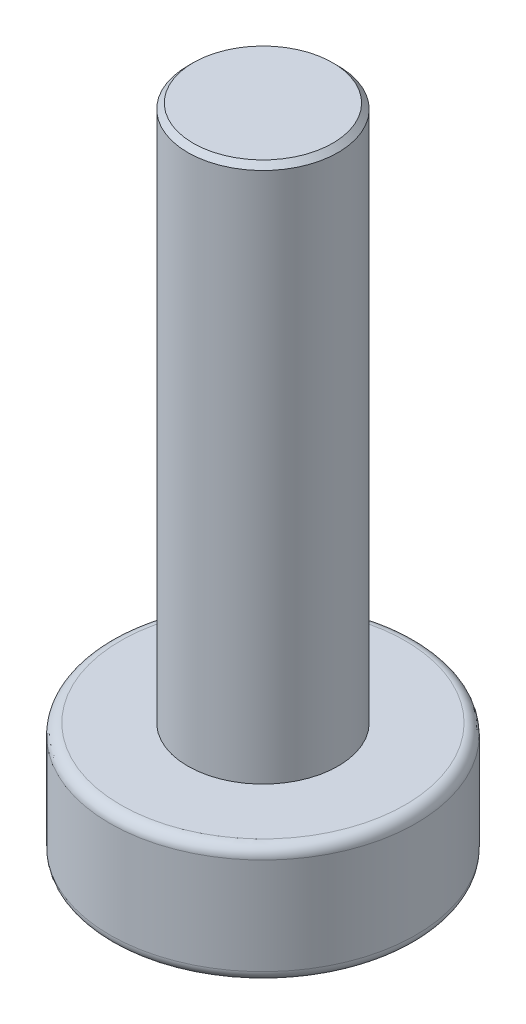
ISO-10303-21;
HEADER;
FILE_DESCRIPTION(('STEP AP214'),'2;1');
FILE_NAME('part.step','',(''),(''),'','','');
FILE_SCHEMA(('AUTOMOTIVE_DESIGN { 1 0 10303 214 1 1 1 1 }'));
ENDSEC;
DATA;
#1=APPLICATION_CONTEXT('core data for automotive mechanical design processes');
#2=APPLICATION_PROTOCOL_DEFINITION('international standard','automotive_design',2000,#1);
#3=PRODUCT_CONTEXT('',#1,'mechanical');
#4=PRODUCT('Part','Part','',(#3));
#5=PRODUCT_RELATED_PRODUCT_CATEGORY('part','',(#4));
#6=PRODUCT_DEFINITION_FORMATION('','',#4);
#7=PRODUCT_DEFINITION_CONTEXT('part definition',#1,'design');
#8=PRODUCT_DEFINITION('design','',#6,#7);
#9=PRODUCT_DEFINITION_SHAPE('','',#8);
#10=(LENGTH_UNIT() NAMED_UNIT(*) SI_UNIT(.MILLI.,.METRE.));
#11=(NAMED_UNIT(*) PLANE_ANGLE_UNIT() SI_UNIT($,.RADIAN.));
#12=(NAMED_UNIT(*) SI_UNIT($,.STERADIAN.) SOLID_ANGLE_UNIT());
#13=UNCERTAINTY_MEASURE_WITH_UNIT(LENGTH_MEASURE(1.E-05),#10,'distance_accuracy_value','');
#14=(GEOMETRIC_REPRESENTATION_CONTEXT(3) GLOBAL_UNCERTAINTY_ASSIGNED_CONTEXT((#13)) GLOBAL_UNIT_ASSIGNED_CONTEXT((#10,
#11,#12)) REPRESENTATION_CONTEXT('',''));
#15=CARTESIAN_POINT('',(0.,0.,0.));
#16=DIRECTION('',(0.,0.,1.));
#17=DIRECTION('',(1.,0.,0.));
#18=AXIS2_PLACEMENT_3D('',#15,#16,#17);
#19=CARTESIAN_POINT('',(0.,2.2,0.));
#20=DIRECTION('',(0.,-1.,0.));
#21=DIRECTION('',(0.,0.,-1.));
#22=AXIS2_PLACEMENT_3D('',#19,#20,#21);
#23=CYLINDRICAL_SURFACE('',#22,2.85);
#24=CARTESIAN_POINT('',(0.,2.,0.));
#25=DIRECTION('',(0.,1.,0.));
#26=DIRECTION('',(0.,0.,1.));
#27=AXIS2_PLACEMENT_3D('',#24,#25,#26);
#28=CIRCLE('',#27,2.85);
#29=CARTESIAN_POINT('',(0.,2.,2.85));
#30=VERTEX_POINT('',#29);
#31=EDGE_CURVE('E44',#30,#30,#28,.F.);
#32=ORIENTED_EDGE('',*,*,#31,.T.);
#33=EDGE_LOOP('',(#32));
#34=FACE_BOUND('',#33,.T.);
#35=CARTESIAN_POINT('',(0.,0.2,0.));
#36=DIRECTION('',(0.,1.,0.));
#37=DIRECTION('',(0.,0.,1.));
#38=AXIS2_PLACEMENT_3D('',#35,#36,#37);
#39=CIRCLE('',#38,2.85);
#40=CARTESIAN_POINT('',(0.,0.2,2.85));
#41=VERTEX_POINT('',#40);
#42=EDGE_CURVE('E221',#41,#41,#39,.T.);
#43=ORIENTED_EDGE('',*,*,#42,.T.);
#44=EDGE_LOOP('',(#43));
#45=FACE_BOUND('',#44,.T.);
#46=ADVANCED_FACE('F36',(#34,#45),#23,.T.);
#47=CARTESIAN_POINT('',(0.,2.2,0.));
#48=DIRECTION('',(0.,1.,0.));
#49=DIRECTION('',(0.,0.,1.));
#50=AXIS2_PLACEMENT_3D('',#47,#48,#49);
#51=PLANE('',#50);
#52=CARTESIAN_POINT('',(0.,2.2,0.));
#53=DIRECTION('',(0.,1.,0.));
#54=DIRECTION('',(0.,0.,1.));
#55=AXIS2_PLACEMENT_3D('',#52,#53,#54);
#56=CIRCLE('',#55,2.65);
#57=CARTESIAN_POINT('',(0.,2.2,2.65));
#58=VERTEX_POINT('',#57);
#59=EDGE_CURVE('E218',#58,#58,#56,.T.);
#60=ORIENTED_EDGE('',*,*,#59,.T.);
#61=EDGE_LOOP('',(#60));
#62=FACE_BOUND('',#61,.T.);
#63=CARTESIAN_POINT('',(0.,2.2,0.));
#64=DIRECTION('',(0.,1.,0.));
#65=DIRECTION('',(0.,0.,1.));
#66=AXIS2_PLACEMENT_3D('',#63,#64,#65);
#67=CIRCLE('',#66,1.4);
#68=CARTESIAN_POINT('',(0.,2.2,1.4));
#69=VERTEX_POINT('',#68);
#70=EDGE_CURVE('E192',#69,#69,#67,.T.);
#71=ORIENTED_EDGE('',*,*,#70,.F.);
#72=EDGE_LOOP('',(#71));
#73=FACE_BOUND('',#72,.T.);
#74=ADVANCED_FACE('F234',(#62,#73),#51,.T.);
#75=CARTESIAN_POINT('',(0.,0.,0.));
#76=DIRECTION('',(0.,1.,0.));
#77=DIRECTION('',(0.,0.,1.));
#78=AXIS2_PLACEMENT_3D('',#75,#76,#77);
#79=PLANE('',#78);
#80=DIRECTION('',(0.,0.,-1.));
#81=VECTOR('',#80,1.);
#82=CARTESIAN_POINT('',(-2.,0.,-0.5));
#83=LINE('',#82,#81);
#84=CARTESIAN_POINT('',(-2.,0.,0.5));
#85=VERTEX_POINT('',#84);
#86=CARTESIAN_POINT('',(-2.,0.,-0.5));
#87=VERTEX_POINT('',#86);
#88=EDGE_CURVE('E161',#85,#87,#83,.T.);
#89=ORIENTED_EDGE('',*,*,#88,.F.);
#90=DIRECTION('',(-1.,0.,0.));
#91=VECTOR('',#90,1.);
#92=CARTESIAN_POINT('',(-2.,0.,0.5));
#93=LINE('',#92,#91);
#94=CARTESIAN_POINT('',(-0.5,0.,0.5));
#95=VERTEX_POINT('',#94);
#96=EDGE_CURVE('E51',#95,#85,#93,.T.);
#97=ORIENTED_EDGE('',*,*,#96,.F.);
#98=DIRECTION('',(0.,0.,-1.));
#99=VECTOR('',#98,1.);
#100=CARTESIAN_POINT('',(-0.5,0.,0.5));
#101=LINE('',#100,#99);
#102=CARTESIAN_POINT('',(-0.5,0.,2.));
#103=VERTEX_POINT('',#102);
#104=EDGE_CURVE('E188',#103,#95,#101,.T.);
#105=ORIENTED_EDGE('',*,*,#104,.F.);
#106=DIRECTION('',(-1.,0.,0.));
#107=VECTOR('',#106,1.);
#108=CARTESIAN_POINT('',(-0.5,0.,2.));
#109=LINE('',#108,#107);
#110=CARTESIAN_POINT('',(0.5,0.,2.));
#111=VERTEX_POINT('',#110);
#112=EDGE_CURVE('E186',#111,#103,#109,.T.);
#113=ORIENTED_EDGE('',*,*,#112,.F.);
#114=DIRECTION('',(0.,0.,1.));
#115=VECTOR('',#114,1.);
#116=CARTESIAN_POINT('',(0.5,0.,2.));
#117=LINE('',#116,#115);
#118=CARTESIAN_POINT('',(0.5,0.,0.5));
#119=VERTEX_POINT('',#118);
#120=EDGE_CURVE('E135',#119,#111,#117,.T.);
#121=ORIENTED_EDGE('',*,*,#120,.F.);
#122=DIRECTION('',(-1.,0.,0.));
#123=VECTOR('',#122,1.);
#124=CARTESIAN_POINT('',(0.5,0.,0.5));
#125=LINE('',#124,#123);
#126=CARTESIAN_POINT('',(2.,0.,0.5));
#127=VERTEX_POINT('',#126);
#128=EDGE_CURVE('E182',#127,#119,#125,.T.);
#129=ORIENTED_EDGE('',*,*,#128,.F.);
#130=DIRECTION('',(0.,0.,1.));
#131=VECTOR('',#130,1.);
#132=CARTESIAN_POINT('',(2.,0.,0.5));
#133=LINE('',#132,#131);
#134=CARTESIAN_POINT('',(2.,0.,-0.5));
#135=VERTEX_POINT('',#134);
#136=EDGE_CURVE('E179',#135,#127,#133,.T.);
#137=ORIENTED_EDGE('',*,*,#136,.F.);
#138=DIRECTION('',(1.,0.,0.));
#139=VECTOR('',#138,1.);
#140=CARTESIAN_POINT('',(2.,0.,-0.5));
#141=LINE('',#140,#139);
#142=CARTESIAN_POINT('',(0.5,0.,-0.5));
#143=VERTEX_POINT('',#142);
#144=EDGE_CURVE('E176',#143,#135,#141,.T.);
#145=ORIENTED_EDGE('',*,*,#144,.F.);
#146=DIRECTION('',(0.,0.,1.));
#147=VECTOR('',#146,1.);
#148=CARTESIAN_POINT('',(0.5,0.,-0.5));
#149=LINE('',#148,#147);
#150=CARTESIAN_POINT('',(0.5,0.,-2.));
#151=VERTEX_POINT('',#150);
#152=EDGE_CURVE('E173',#151,#143,#149,.T.);
#153=ORIENTED_EDGE('',*,*,#152,.F.);
#154=DIRECTION('',(1.,0.,0.));
#155=VECTOR('',#154,1.);
#156=CARTESIAN_POINT('',(0.5,0.,-2.));
#157=LINE('',#156,#155);
#158=CARTESIAN_POINT('',(-0.5,0.,-2.));
#159=VERTEX_POINT('',#158);
#160=EDGE_CURVE('E170',#159,#151,#157,.T.);
#161=ORIENTED_EDGE('',*,*,#160,.F.);
#162=DIRECTION('',(0.,0.,-1.));
#163=VECTOR('',#162,1.);
#164=CARTESIAN_POINT('',(-0.5,0.,-2.));
#165=LINE('',#164,#163);
#166=CARTESIAN_POINT('',(-0.5,0.,-0.5));
#167=VERTEX_POINT('',#166);
#168=EDGE_CURVE('E167',#167,#159,#165,.T.);
#169=ORIENTED_EDGE('',*,*,#168,.F.);
#170=DIRECTION('',(1.,0.,0.));
#171=VECTOR('',#170,1.);
#172=CARTESIAN_POINT('',(-0.5,0.,-0.5));
#173=LINE('',#172,#171);
#174=EDGE_CURVE('E164',#87,#167,#173,.T.);
#175=ORIENTED_EDGE('',*,*,#174,.F.);
#176=EDGE_LOOP('',(#89,#97,#105,#113,#121,#129,#137,#145,#153,#161,#169,#175));
#177=FACE_BOUND('',#176,.T.);
#178=CARTESIAN_POINT('',(0.,0.,0.));
#179=DIRECTION('',(0.,1.,0.));
#180=DIRECTION('',(0.,0.,1.));
#181=AXIS2_PLACEMENT_3D('',#178,#179,#180);
#182=CIRCLE('',#181,2.65);
#183=CARTESIAN_POINT('',(0.,0.,2.65));
#184=VERTEX_POINT('',#183);
#185=EDGE_CURVE('E11',#184,#184,#182,.F.);
#186=ORIENTED_EDGE('',*,*,#185,.T.);
#187=EDGE_LOOP('',(#186));
#188=FACE_BOUND('',#187,.T.);
#189=ADVANCED_FACE('F237',(#177,#188),#79,.F.);
#190=CARTESIAN_POINT('',(0.,12.2,0.));
#191=DIRECTION('',(0.,-1.,0.));
#192=DIRECTION('',(0.,0.,-1.));
#193=AXIS2_PLACEMENT_3D('',#190,#191,#192);
#194=CYLINDRICAL_SURFACE('',#193,1.4);
#195=CARTESIAN_POINT('',(0.,12.1,0.));
#196=DIRECTION('',(0.,1.,0.));
#197=DIRECTION('',(0.,0.,1.));
#198=AXIS2_PLACEMENT_3D('',#195,#196,#197);
#199=CIRCLE('',#198,1.4);
#200=CARTESIAN_POINT('',(0.,12.1,1.4));
#201=VERTEX_POINT('',#200);
#202=EDGE_CURVE('E215',#201,#201,#199,.F.);
#203=ORIENTED_EDGE('',*,*,#202,.T.);
#204=EDGE_LOOP('',(#203));
#205=FACE_BOUND('',#204,.T.);
#206=ORIENTED_EDGE('',*,*,#70,.T.);
#207=EDGE_LOOP('',(#206));
#208=FACE_BOUND('',#207,.T.);
#209=ADVANCED_FACE('F241',(#205,#208),#194,.T.);
#210=CARTESIAN_POINT('',(0.,12.2,0.));
#211=DIRECTION('',(0.,1.,0.));
#212=DIRECTION('',(0.,0.,1.));
#213=AXIS2_PLACEMENT_3D('',#210,#211,#212);
#214=PLANE('',#213);
#215=CARTESIAN_POINT('',(0.,12.2,0.));
#216=DIRECTION('',(0.,1.,0.));
#217=DIRECTION('',(0.,0.,1.));
#218=AXIS2_PLACEMENT_3D('',#215,#216,#217);
#219=CIRCLE('',#218,1.3);
#220=CARTESIAN_POINT('',(0.,12.2,1.3));
#221=VERTEX_POINT('',#220);
#222=EDGE_CURVE('E212',#221,#221,#219,.T.);
#223=ORIENTED_EDGE('',*,*,#222,.T.);
#224=EDGE_LOOP('',(#223));
#225=FACE_BOUND('',#224,.T.);
#226=ADVANCED_FACE('F243',(#225),#214,.T.);
#227=CARTESIAN_POINT('',(0.,12.2,0.));
#228=DIRECTION('',(0.,-1.,0.));
#229=DIRECTION('',(0.,0.,-1.));
#230=AXIS2_PLACEMENT_3D('',#227,#228,#229);
#231=CONICAL_SURFACE('',#230,1.3,0.785398163397457);
#232=ORIENTED_EDGE('',*,*,#202,.F.);
#233=EDGE_LOOP('',(#232));
#234=FACE_BOUND('',#233,.T.);
#235=ORIENTED_EDGE('',*,*,#222,.F.);
#236=EDGE_LOOP('',(#235));
#237=FACE_BOUND('',#236,.T.);
#238=ADVANCED_FACE('F231',(#234,#237),#231,.T.);
#239=CARTESIAN_POINT('',(0.,2.,0.));
#240=DIRECTION('',(0.,1.,0.));
#241=DIRECTION('',(0.,0.,1.));
#242=AXIS2_PLACEMENT_3D('',#239,#240,#241);
#243=TOROIDAL_SURFACE('',#242,2.65,0.2);
#244=ORIENTED_EDGE('',*,*,#31,.F.);
#245=EDGE_LOOP('',(#244));
#246=FACE_BOUND('',#245,.T.);
#247=ORIENTED_EDGE('',*,*,#59,.F.);
#248=EDGE_LOOP('',(#247));
#249=FACE_BOUND('',#248,.T.);
#250=ADVANCED_FACE('F228',(#246,#249),#243,.T.);
#251=CARTESIAN_POINT('',(0.,0.2,0.));
#252=DIRECTION('',(0.,1.,0.));
#253=DIRECTION('',(0.,0.,1.));
#254=AXIS2_PLACEMENT_3D('',#251,#252,#253);
#255=TOROIDAL_SURFACE('',#254,2.65,0.2);
#256=ORIENTED_EDGE('',*,*,#185,.F.);
#257=EDGE_LOOP('',(#256));
#258=FACE_BOUND('',#257,.T.);
#259=ORIENTED_EDGE('',*,*,#42,.F.);
#260=EDGE_LOOP('',(#259));
#261=FACE_BOUND('',#260,.T.);
#262=ADVANCED_FACE('F38',(#258,#261),#255,.T.);
#263=CARTESIAN_POINT('',(-2.,1.5,0.5));
#264=DIRECTION('',(0.,0.,1.));
#265=DIRECTION('',(1.,0.,0.));
#266=AXIS2_PLACEMENT_3D('',#263,#264,#265);
#267=PLANE('',#266);
#268=ORIENTED_EDGE('',*,*,#96,.T.);
#269=DIRECTION('',(0.,-1.,0.));
#270=VECTOR('',#269,1.);
#271=CARTESIAN_POINT('',(-2.,1.5,0.5));
#272=LINE('',#271,#270);
#273=CARTESIAN_POINT('',(-2.,1.5,0.5));
#274=VERTEX_POINT('',#273);
#275=EDGE_CURVE('E99',#274,#85,#272,.T.);
#276=ORIENTED_EDGE('',*,*,#275,.F.);
#277=DIRECTION('',(-1.,0.,0.));
#278=VECTOR('',#277,1.);
#279=CARTESIAN_POINT('',(-2.,1.5,0.5));
#280=LINE('',#279,#278);
#281=CARTESIAN_POINT('',(-0.5,1.5,0.5));
#282=VERTEX_POINT('',#281);
#283=EDGE_CURVE('E190',#282,#274,#280,.T.);
#284=ORIENTED_EDGE('',*,*,#283,.F.);
#285=DIRECTION('',(0.,-1.,0.));
#286=VECTOR('',#285,1.);
#287=CARTESIAN_POINT('',(-0.5,1.5,0.5));
#288=LINE('',#287,#286);
#289=EDGE_CURVE('E59',#282,#95,#288,.T.);
#290=ORIENTED_EDGE('',*,*,#289,.T.);
#291=EDGE_LOOP('',(#268,#276,#284,#290));
#292=FACE_BOUND('',#291,.T.);
#293=ADVANCED_FACE('F279',(#292),#267,.F.);
#294=CARTESIAN_POINT('',(-0.5,1.5,0.5));
#295=DIRECTION('',(-1.,0.,0.));
#296=DIRECTION('',(0.,0.,1.));
#297=AXIS2_PLACEMENT_3D('',#294,#295,#296);
#298=PLANE('',#297);
#299=ORIENTED_EDGE('',*,*,#104,.T.);
#300=ORIENTED_EDGE('',*,*,#289,.F.);
#301=DIRECTION('',(0.,0.,-1.));
#302=VECTOR('',#301,1.);
#303=CARTESIAN_POINT('',(-0.5,1.5,0.5));
#304=LINE('',#303,#302);
#305=CARTESIAN_POINT('',(-0.5,1.5,2.));
#306=VERTEX_POINT('',#305);
#307=EDGE_CURVE('E147',#306,#282,#304,.T.);
#308=ORIENTED_EDGE('',*,*,#307,.F.);
#309=DIRECTION('',(0.,-1.,0.));
#310=VECTOR('',#309,1.);
#311=CARTESIAN_POINT('',(-0.5,1.5,2.));
#312=LINE('',#311,#310);
#313=EDGE_CURVE('E139',#306,#103,#312,.T.);
#314=ORIENTED_EDGE('',*,*,#313,.T.);
#315=EDGE_LOOP('',(#299,#300,#308,#314));
#316=FACE_BOUND('',#315,.T.);
#317=ADVANCED_FACE('F287',(#316),#298,.F.);
#318=CARTESIAN_POINT('',(-0.5,1.5,2.));
#319=DIRECTION('',(0.,0.,1.));
#320=DIRECTION('',(1.,0.,0.));
#321=AXIS2_PLACEMENT_3D('',#318,#319,#320);
#322=PLANE('',#321);
#323=ORIENTED_EDGE('',*,*,#112,.T.);
#324=ORIENTED_EDGE('',*,*,#313,.F.);
#325=DIRECTION('',(-1.,0.,0.));
#326=VECTOR('',#325,1.);
#327=CARTESIAN_POINT('',(-0.5,1.5,2.));
#328=LINE('',#327,#326);
#329=CARTESIAN_POINT('',(0.5,1.5,2.));
#330=VERTEX_POINT('',#329);
#331=EDGE_CURVE('E143',#330,#306,#328,.T.);
#332=ORIENTED_EDGE('',*,*,#331,.F.);
#333=DIRECTION('',(0.,-1.,0.));
#334=VECTOR('',#333,1.);
#335=CARTESIAN_POINT('',(0.5,1.5,2.));
#336=LINE('',#335,#334);
#337=EDGE_CURVE('E128',#330,#111,#336,.T.);
#338=ORIENTED_EDGE('',*,*,#337,.T.);
#339=EDGE_LOOP('',(#323,#324,#332,#338));
#340=FACE_BOUND('',#339,.T.);
#341=ADVANCED_FACE('F144',(#340),#322,.F.);
#342=CARTESIAN_POINT('',(0.5,1.5,2.));
#343=DIRECTION('',(1.,0.,0.));
#344=DIRECTION('',(0.,0.,-1.));
#345=AXIS2_PLACEMENT_3D('',#342,#343,#344);
#346=PLANE('',#345);
#347=ORIENTED_EDGE('',*,*,#120,.T.);
#348=ORIENTED_EDGE('',*,*,#337,.F.);
#349=DIRECTION('',(0.,0.,1.));
#350=VECTOR('',#349,1.);
#351=CARTESIAN_POINT('',(0.5,1.5,2.));
#352=LINE('',#351,#350);
#353=CARTESIAN_POINT('',(0.5,1.5,0.5));
#354=VERTEX_POINT('',#353);
#355=EDGE_CURVE('E132',#354,#330,#352,.T.);
#356=ORIENTED_EDGE('',*,*,#355,.F.);
#357=DIRECTION('',(0.,-1.,0.));
#358=VECTOR('',#357,1.);
#359=CARTESIAN_POINT('',(0.5,1.5,0.5));
#360=LINE('',#359,#358);
#361=EDGE_CURVE('E140',#354,#119,#360,.T.);
#362=ORIENTED_EDGE('',*,*,#361,.T.);
#363=EDGE_LOOP('',(#347,#348,#356,#362));
#364=FACE_BOUND('',#363,.T.);
#365=ADVANCED_FACE('F130',(#364),#346,.F.);
#366=CARTESIAN_POINT('',(0.5,1.5,0.5));
#367=DIRECTION('',(0.,0.,1.));
#368=DIRECTION('',(1.,0.,0.));
#369=AXIS2_PLACEMENT_3D('',#366,#367,#368);
#370=PLANE('',#369);
#371=ORIENTED_EDGE('',*,*,#128,.T.);
#372=ORIENTED_EDGE('',*,*,#361,.F.);
#373=DIRECTION('',(-1.,0.,0.));
#374=VECTOR('',#373,1.);
#375=CARTESIAN_POINT('',(0.5,1.5,0.5));
#376=LINE('',#375,#374);
#377=CARTESIAN_POINT('',(2.,1.5,0.5));
#378=VERTEX_POINT('',#377);
#379=EDGE_CURVE('E153',#378,#354,#376,.T.);
#380=ORIENTED_EDGE('',*,*,#379,.F.);
#381=DIRECTION('',(0.,-1.,0.));
#382=VECTOR('',#381,1.);
#383=CARTESIAN_POINT('',(2.,1.5,0.5));
#384=LINE('',#383,#382);
#385=EDGE_CURVE('E195',#378,#127,#384,.T.);
#386=ORIENTED_EDGE('',*,*,#385,.T.);
#387=EDGE_LOOP('',(#371,#372,#380,#386));
#388=FACE_BOUND('',#387,.T.);
#389=ADVANCED_FACE('F306',(#388),#370,.F.);
#390=CARTESIAN_POINT('',(2.,1.5,0.5));
#391=DIRECTION('',(1.,0.,0.));
#392=DIRECTION('',(0.,0.,-1.));
#393=AXIS2_PLACEMENT_3D('',#390,#391,#392);
#394=PLANE('',#393);
#395=ORIENTED_EDGE('',*,*,#136,.T.);
#396=ORIENTED_EDGE('',*,*,#385,.F.);
#397=DIRECTION('',(0.,0.,1.));
#398=VECTOR('',#397,1.);
#399=CARTESIAN_POINT('',(2.,1.5,0.5));
#400=LINE('',#399,#398);
#401=CARTESIAN_POINT('',(2.,1.5,-0.5));
#402=VERTEX_POINT('',#401);
#403=EDGE_CURVE('E155',#402,#378,#400,.T.);
#404=ORIENTED_EDGE('',*,*,#403,.F.);
#405=DIRECTION('',(0.,-1.,0.));
#406=VECTOR('',#405,1.);
#407=CARTESIAN_POINT('',(2.,1.5,-0.5));
#408=LINE('',#407,#406);
#409=EDGE_CURVE('E197',#402,#135,#408,.T.);
#410=ORIENTED_EDGE('',*,*,#409,.T.);
#411=EDGE_LOOP('',(#395,#396,#404,#410));
#412=FACE_BOUND('',#411,.T.);
#413=ADVANCED_FACE('F313',(#412),#394,.F.);
#414=CARTESIAN_POINT('',(2.,1.5,-0.5));
#415=DIRECTION('',(0.,0.,-1.));
#416=DIRECTION('',(-1.,0.,0.));
#417=AXIS2_PLACEMENT_3D('',#414,#415,#416);
#418=PLANE('',#417);
#419=ORIENTED_EDGE('',*,*,#144,.T.);
#420=ORIENTED_EDGE('',*,*,#409,.F.);
#421=DIRECTION('',(1.,0.,0.));
#422=VECTOR('',#421,1.);
#423=CARTESIAN_POINT('',(2.,1.5,-0.5));
#424=LINE('',#423,#422);
#425=CARTESIAN_POINT('',(0.5,1.5,-0.5));
#426=VERTEX_POINT('',#425);
#427=EDGE_CURVE('E456',#426,#402,#424,.T.);
#428=ORIENTED_EDGE('',*,*,#427,.F.);
#429=DIRECTION('',(0.,-1.,0.));
#430=VECTOR('',#429,1.);
#431=CARTESIAN_POINT('',(0.5,1.5,-0.5));
#432=LINE('',#431,#430);
#433=EDGE_CURVE('E199',#426,#143,#432,.T.);
#434=ORIENTED_EDGE('',*,*,#433,.T.);
#435=EDGE_LOOP('',(#419,#420,#428,#434));
#436=FACE_BOUND('',#435,.T.);
#437=ADVANCED_FACE('F321',(#436),#418,.F.);
#438=CARTESIAN_POINT('',(0.5,1.5,-0.5));
#439=DIRECTION('',(1.,0.,0.));
#440=DIRECTION('',(0.,0.,-1.));
#441=AXIS2_PLACEMENT_3D('',#438,#439,#440);
#442=PLANE('',#441);
#443=ORIENTED_EDGE('',*,*,#152,.T.);
#444=ORIENTED_EDGE('',*,*,#433,.F.);
#445=DIRECTION('',(0.,0.,1.));
#446=VECTOR('',#445,1.);
#447=CARTESIAN_POINT('',(0.5,1.5,-0.5));
#448=LINE('',#447,#446);
#449=CARTESIAN_POINT('',(0.5,1.5,-2.));
#450=VERTEX_POINT('',#449);
#451=EDGE_CURVE('E453',#450,#426,#448,.T.);
#452=ORIENTED_EDGE('',*,*,#451,.F.);
#453=DIRECTION('',(0.,-1.,0.));
#454=VECTOR('',#453,1.);
#455=CARTESIAN_POINT('',(0.5,1.5,-2.));
#456=LINE('',#455,#454);
#457=EDGE_CURVE('E201',#450,#151,#456,.T.);
#458=ORIENTED_EDGE('',*,*,#457,.T.);
#459=EDGE_LOOP('',(#443,#444,#452,#458));
#460=FACE_BOUND('',#459,.T.);
#461=ADVANCED_FACE('F329',(#460),#442,.F.);
#462=CARTESIAN_POINT('',(0.5,1.5,-2.));
#463=DIRECTION('',(0.,0.,-1.));
#464=DIRECTION('',(-1.,0.,0.));
#465=AXIS2_PLACEMENT_3D('',#462,#463,#464);
#466=PLANE('',#465);
#467=ORIENTED_EDGE('',*,*,#160,.T.);
#468=ORIENTED_EDGE('',*,*,#457,.F.);
#469=DIRECTION('',(1.,0.,0.));
#470=VECTOR('',#469,1.);
#471=CARTESIAN_POINT('',(0.5,1.5,-2.));
#472=LINE('',#471,#470);
#473=CARTESIAN_POINT('',(-0.5,1.5,-2.));
#474=VERTEX_POINT('',#473);
#475=EDGE_CURVE('E450',#474,#450,#472,.T.);
#476=ORIENTED_EDGE('',*,*,#475,.F.);
#477=DIRECTION('',(0.,-1.,0.));
#478=VECTOR('',#477,1.);
#479=CARTESIAN_POINT('',(-0.5,1.5,-2.));
#480=LINE('',#479,#478);
#481=EDGE_CURVE('E203',#474,#159,#480,.T.);
#482=ORIENTED_EDGE('',*,*,#481,.T.);
#483=EDGE_LOOP('',(#467,#468,#476,#482));
#484=FACE_BOUND('',#483,.T.);
#485=ADVANCED_FACE('F337',(#484),#466,.F.);
#486=CARTESIAN_POINT('',(-0.5,1.5,-2.));
#487=DIRECTION('',(-1.,0.,0.));
#488=DIRECTION('',(0.,0.,1.));
#489=AXIS2_PLACEMENT_3D('',#486,#487,#488);
#490=PLANE('',#489);
#491=ORIENTED_EDGE('',*,*,#168,.T.);
#492=ORIENTED_EDGE('',*,*,#481,.F.);
#493=DIRECTION('',(0.,0.,-1.));
#494=VECTOR('',#493,1.);
#495=CARTESIAN_POINT('',(-0.5,1.5,-2.));
#496=LINE('',#495,#494);
#497=CARTESIAN_POINT('',(-0.5,1.5,-0.5));
#498=VERTEX_POINT('',#497);
#499=EDGE_CURVE('E443',#498,#474,#496,.T.);
#500=ORIENTED_EDGE('',*,*,#499,.F.);
#501=DIRECTION('',(0.,-1.,0.));
#502=VECTOR('',#501,1.);
#503=CARTESIAN_POINT('',(-0.5,1.5,-0.5));
#504=LINE('',#503,#502);
#505=EDGE_CURVE('E205',#498,#167,#504,.T.);
#506=ORIENTED_EDGE('',*,*,#505,.T.);
#507=EDGE_LOOP('',(#491,#492,#500,#506));
#508=FACE_BOUND('',#507,.T.);
#509=ADVANCED_FACE('F345',(#508),#490,.F.);
#510=CARTESIAN_POINT('',(-0.5,1.5,-0.5));
#511=DIRECTION('',(0.,0.,-1.));
#512=DIRECTION('',(-1.,0.,0.));
#513=AXIS2_PLACEMENT_3D('',#510,#511,#512);
#514=PLANE('',#513);
#515=ORIENTED_EDGE('',*,*,#174,.T.);
#516=ORIENTED_EDGE('',*,*,#505,.F.);
#517=DIRECTION('',(1.,0.,0.));
#518=VECTOR('',#517,1.);
#519=CARTESIAN_POINT('',(-0.5,1.5,-0.5));
#520=LINE('',#519,#518);
#521=CARTESIAN_POINT('',(-2.,1.5,-0.5));
#522=VERTEX_POINT('',#521);
#523=EDGE_CURVE('E440',#522,#498,#520,.T.);
#524=ORIENTED_EDGE('',*,*,#523,.F.);
#525=DIRECTION('',(0.,-1.,0.));
#526=VECTOR('',#525,1.);
#527=CARTESIAN_POINT('',(-2.,1.5,-0.5));
#528=LINE('',#527,#526);
#529=EDGE_CURVE('E207',#522,#87,#528,.T.);
#530=ORIENTED_EDGE('',*,*,#529,.T.);
#531=EDGE_LOOP('',(#515,#516,#524,#530));
#532=FACE_BOUND('',#531,.T.);
#533=ADVANCED_FACE('F353',(#532),#514,.F.);
#534=CARTESIAN_POINT('',(-2.,1.5,-0.5));
#535=DIRECTION('',(-1.,0.,0.));
#536=DIRECTION('',(0.,0.,1.));
#537=AXIS2_PLACEMENT_3D('',#534,#535,#536);
#538=PLANE('',#537);
#539=ORIENTED_EDGE('',*,*,#88,.T.);
#540=ORIENTED_EDGE('',*,*,#529,.F.);
#541=DIRECTION('',(0.,0.,-1.));
#542=VECTOR('',#541,1.);
#543=CARTESIAN_POINT('',(-2.,1.5,-0.5));
#544=LINE('',#543,#542);
#545=EDGE_CURVE('E444',#274,#522,#544,.T.);
#546=ORIENTED_EDGE('',*,*,#545,.F.);
#547=ORIENTED_EDGE('',*,*,#275,.T.);
#548=EDGE_LOOP('',(#539,#540,#546,#547));
#549=FACE_BOUND('',#548,.T.);
#550=ADVANCED_FACE('F361',(#549),#538,.F.);
#551=CARTESIAN_POINT('',(0.,1.5,0.));
#552=DIRECTION('',(0.,-1.,0.));
#553=DIRECTION('',(0.,0.,-1.));
#554=AXIS2_PLACEMENT_3D('',#551,#552,#553);
#555=PLANE('',#554);
#556=ORIENTED_EDGE('',*,*,#283,.T.);
#557=ORIENTED_EDGE('',*,*,#545,.T.);
#558=ORIENTED_EDGE('',*,*,#523,.T.);
#559=ORIENTED_EDGE('',*,*,#499,.T.);
#560=ORIENTED_EDGE('',*,*,#475,.T.);
#561=ORIENTED_EDGE('',*,*,#451,.T.);
#562=ORIENTED_EDGE('',*,*,#427,.T.);
#563=ORIENTED_EDGE('',*,*,#403,.T.);
#564=ORIENTED_EDGE('',*,*,#379,.T.);
#565=ORIENTED_EDGE('',*,*,#355,.T.);
#566=ORIENTED_EDGE('',*,*,#331,.T.);
#567=ORIENTED_EDGE('',*,*,#307,.T.);
#568=EDGE_LOOP('',(#556,#557,#558,#559,#560,#561,#562,#563,#564,#565,#566,#567));
#569=FACE_BOUND('',#568,.T.);
#570=ADVANCED_FACE('F150',(#569),#555,.T.);
#571=CLOSED_SHELL('',(#46,#74,#189,#209,#226,#238,#250,#262,#293,#317,#341,#365,#389,#413,#437,
#461,#485,#509,#533,#550,#570));
#572=MANIFOLD_SOLID_BREP('B2',#571);
#573=ADVANCED_BREP_SHAPE_REPRESENTATION('',(#18,#572),#14);
#574=SHAPE_DEFINITION_REPRESENTATION(#9,#573);
ENDSEC;
END-ISO-10303-21;
